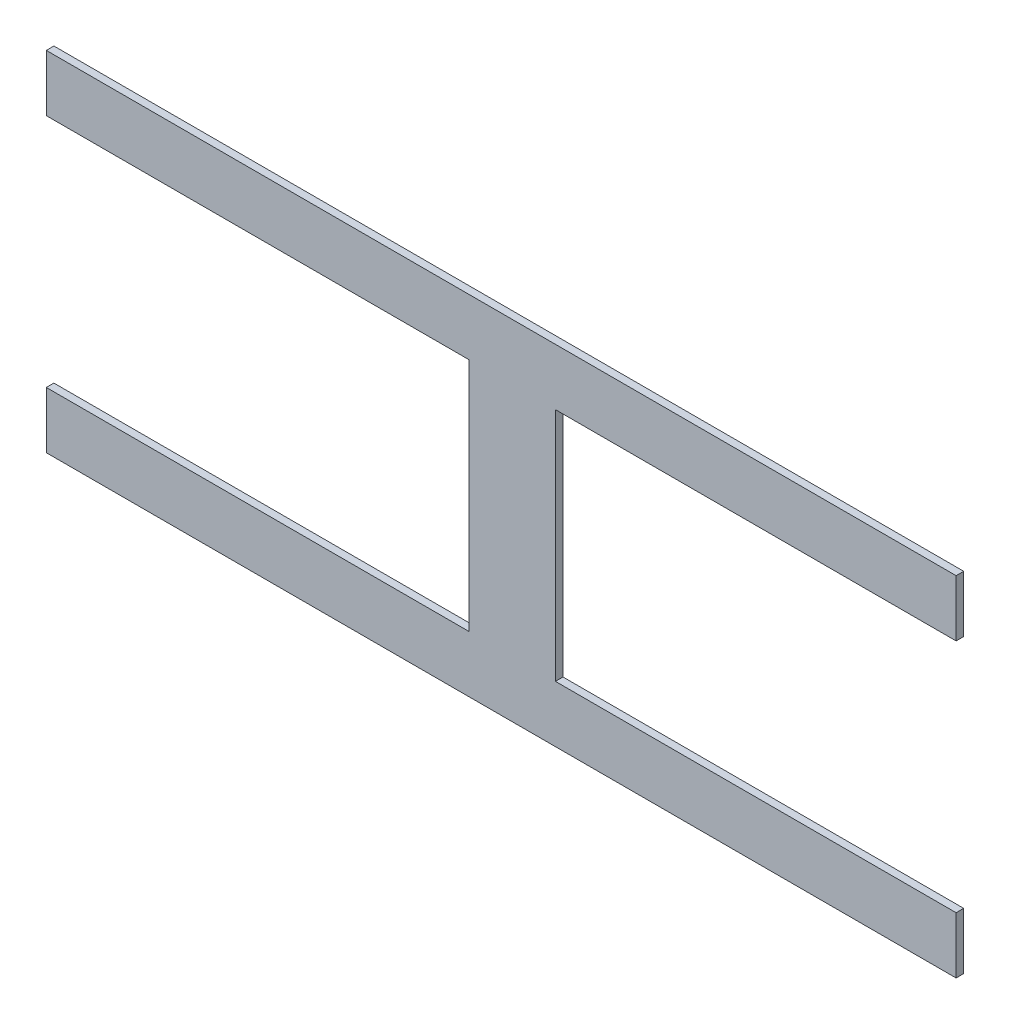
ISO-10303-21;
HEADER;
FILE_DESCRIPTION(('STEP AP214'),'2;1');
FILE_NAME('part.step','',(''),(''),'','','');
FILE_SCHEMA(('AUTOMOTIVE_DESIGN { 1 0 10303 214 1 1 1 1 }'));
ENDSEC;
DATA;
#1=APPLICATION_CONTEXT('core data for automotive mechanical design processes');
#2=APPLICATION_PROTOCOL_DEFINITION('international standard','automotive_design',2000,#1);
#3=PRODUCT_CONTEXT('',#1,'mechanical');
#4=PRODUCT('Part','Part','',(#3));
#5=PRODUCT_RELATED_PRODUCT_CATEGORY('part','',(#4));
#6=PRODUCT_DEFINITION_FORMATION('','',#4);
#7=PRODUCT_DEFINITION_CONTEXT('part definition',#1,'design');
#8=PRODUCT_DEFINITION('design','',#6,#7);
#9=PRODUCT_DEFINITION_SHAPE('','',#8);
#10=(LENGTH_UNIT() NAMED_UNIT(*) SI_UNIT(.MILLI.,.METRE.));
#11=(NAMED_UNIT(*) PLANE_ANGLE_UNIT() SI_UNIT($,.RADIAN.));
#12=(NAMED_UNIT(*) SI_UNIT($,.STERADIAN.) SOLID_ANGLE_UNIT());
#13=UNCERTAINTY_MEASURE_WITH_UNIT(LENGTH_MEASURE(1.E-05),#10,'distance_accuracy_value','');
#14=(GEOMETRIC_REPRESENTATION_CONTEXT(3) GLOBAL_UNCERTAINTY_ASSIGNED_CONTEXT((#13)) GLOBAL_UNIT_ASSIGNED_CONTEXT((#10,
#11,#12)) REPRESENTATION_CONTEXT('',''));
#15=CARTESIAN_POINT('',(0.,0.,0.));
#16=DIRECTION('',(0.,0.,1.));
#17=DIRECTION('',(1.,0.,0.));
#18=AXIS2_PLACEMENT_3D('',#15,#16,#17);
#19=CARTESIAN_POINT('',(186.200114357348,103.662507702251,5.95));
#20=DIRECTION('',(0.,0.,1.));
#21=DIRECTION('',(1.,0.,0.));
#22=AXIS2_PLACEMENT_3D('',#19,#20,#21);
#23=PLANE('',#22);
#24=DIRECTION('',(1.,0.,0.));
#25=VECTOR('',#24,1.);
#26=CARTESIAN_POINT('',(186.200114357348,104.035397736619,5.95));
#27=LINE('',#26,#25);
#28=CARTESIAN_POINT('',(198.200000000001,104.035397736619,5.95));
#29=VERTEX_POINT('',#28);
#30=CARTESIAN_POINT('',(186.200114357348,104.035397736619,5.95));
#31=VERTEX_POINT('',#30);
#32=EDGE_CURVE('E175',#29,#31,#27,.F.);
#33=ORIENTED_EDGE('',*,*,#32,.F.);
#34=DIRECTION('',(0.,1.,0.));
#35=VECTOR('',#34,1.);
#36=CARTESIAN_POINT('',(198.200000000001,104.035397736619,5.95));
#37=LINE('',#36,#35);
#38=CARTESIAN_POINT('',(198.200000000001,103.289617667884,5.95));
#39=VERTEX_POINT('',#38);
#40=EDGE_CURVE('E170',#39,#29,#37,.T.);
#41=ORIENTED_EDGE('',*,*,#40,.F.);
#42=DIRECTION('',(1.,0.,0.));
#43=VECTOR('',#42,1.);
#44=CARTESIAN_POINT('',(198.200000000001,103.289617667884,5.95));
#45=LINE('',#44,#43);
#46=CARTESIAN_POINT('',(192.914714211389,103.289617667884,5.95));
#47=VERTEX_POINT('',#46);
#48=EDGE_CURVE('E164',#47,#39,#45,.T.);
#49=ORIENTED_EDGE('',*,*,#48,.F.);
#50=DIRECTION('',(0.,1.,0.));
#51=VECTOR('',#50,1.);
#52=CARTESIAN_POINT('',(192.914714211389,103.289617667884,5.95));
#53=LINE('',#52,#51);
#54=CARTESIAN_POINT('',(192.914714211389,100.185329464155,5.95));
#55=VERTEX_POINT('',#54);
#56=EDGE_CURVE('E158',#55,#47,#53,.T.);
#57=ORIENTED_EDGE('',*,*,#56,.F.);
#58=DIRECTION('',(1.,0.,0.));
#59=VECTOR('',#58,1.);
#60=CARTESIAN_POINT('',(192.914714211389,100.185329464155,5.95));
#61=LINE('',#60,#59);
#62=CARTESIAN_POINT('',(198.200000000001,100.185329464155,5.95));
#63=VERTEX_POINT('',#62);
#64=EDGE_CURVE('E152',#63,#55,#61,.F.);
#65=ORIENTED_EDGE('',*,*,#64,.F.);
#66=DIRECTION('',(0.,1.,0.));
#67=VECTOR('',#66,1.);
#68=CARTESIAN_POINT('',(198.200000000001,100.185329464155,5.95));
#69=LINE('',#68,#67);
#70=CARTESIAN_POINT('',(198.200000000001,99.4395493954192,5.95));
#71=VERTEX_POINT('',#70);
#72=EDGE_CURVE('E146',#71,#63,#69,.T.);
#73=ORIENTED_EDGE('',*,*,#72,.F.);
#74=DIRECTION('',(1.,0.,0.));
#75=VECTOR('',#74,1.);
#76=CARTESIAN_POINT('',(198.200000000001,99.4395493954192,5.95));
#77=LINE('',#76,#75);
#78=CARTESIAN_POINT('',(186.200114357348,99.4395493954192,5.95));
#79=VERTEX_POINT('',#78);
#80=EDGE_CURVE('E140',#79,#71,#77,.T.);
#81=ORIENTED_EDGE('',*,*,#80,.F.);
#82=DIRECTION('',(0.,1.,0.));
#83=VECTOR('',#82,1.);
#84=CARTESIAN_POINT('',(186.200114357348,99.4395493954192,5.95));
#85=LINE('',#84,#83);
#86=CARTESIAN_POINT('',(186.200114357348,100.185329464155,5.95));
#87=VERTEX_POINT('',#86);
#88=EDGE_CURVE('E134',#87,#79,#85,.F.);
#89=ORIENTED_EDGE('',*,*,#88,.F.);
#90=DIRECTION('',(1.,0.,0.));
#91=VECTOR('',#90,1.);
#92=CARTESIAN_POINT('',(186.200114357348,100.185329464155,5.95));
#93=LINE('',#92,#91);
#94=CARTESIAN_POINT('',(191.774439212524,100.185329464155,5.95));
#95=VERTEX_POINT('',#94);
#96=EDGE_CURVE('E128',#95,#87,#93,.F.);
#97=ORIENTED_EDGE('',*,*,#96,.F.);
#98=DIRECTION('',(0.,1.,0.));
#99=VECTOR('',#98,1.);
#100=CARTESIAN_POINT('',(191.774439212524,100.185329464155,5.95));
#101=LINE('',#100,#99);
#102=CARTESIAN_POINT('',(191.774439212524,103.289617667884,5.95));
#103=VERTEX_POINT('',#102);
#104=EDGE_CURVE('E104',#103,#95,#101,.F.);
#105=ORIENTED_EDGE('',*,*,#104,.F.);
#106=DIRECTION('',(1.,0.,0.));
#107=VECTOR('',#106,1.);
#108=CARTESIAN_POINT('',(191.774439212524,103.289617667884,5.95));
#109=LINE('',#108,#107);
#110=CARTESIAN_POINT('',(186.200114357348,103.289617667884,5.95));
#111=VERTEX_POINT('',#110);
#112=EDGE_CURVE('E106',#111,#103,#109,.T.);
#113=ORIENTED_EDGE('',*,*,#112,.F.);
#114=DIRECTION('',(0.,1.,0.));
#115=VECTOR('',#114,1.);
#116=CARTESIAN_POINT('',(186.200114357348,103.289617667884,5.95));
#117=LINE('',#116,#115);
#118=EDGE_CURVE('E20',#31,#111,#117,.F.);
#119=ORIENTED_EDGE('',*,*,#118,.F.);
#120=EDGE_LOOP('',(#33,#41,#49,#57,#65,#73,#81,#89,#97,#105,#113,#119));
#121=FACE_BOUND('',#120,.T.);
#122=ADVANCED_FACE('F17',(#121),#23,.F.);
#123=CARTESIAN_POINT('',(186.200114357348,103.289617667884,6.05));
#124=DIRECTION('',(-1.,0.,0.));
#125=DIRECTION('',(0.,0.,1.));
#126=AXIS2_PLACEMENT_3D('',#123,#124,#125);
#127=PLANE('',#126);
#128=DIRECTION('',(0.,1.,0.));
#129=VECTOR('',#128,1.);
#130=CARTESIAN_POINT('',(186.200114357348,103.662507702251,6.05));
#131=LINE('',#130,#129);
#132=CARTESIAN_POINT('',(186.200114357348,104.035397736619,6.05));
#133=VERTEX_POINT('',#132);
#134=CARTESIAN_POINT('',(186.200114357348,103.289617667884,6.05));
#135=VERTEX_POINT('',#134);
#136=EDGE_CURVE('E179',#133,#135,#131,.F.);
#137=ORIENTED_EDGE('',*,*,#136,.F.);
#138=DIRECTION('',(0.,0.,1.));
#139=VECTOR('',#138,1.);
#140=CARTESIAN_POINT('',(186.200114357348,104.035397736619,6.05));
#141=LINE('',#140,#139);
#142=EDGE_CURVE('E117',#31,#133,#141,.T.);
#143=ORIENTED_EDGE('',*,*,#142,.F.);
#144=ORIENTED_EDGE('',*,*,#118,.T.);
#145=DIRECTION('',(0.,0.,-1.));
#146=VECTOR('',#145,1.);
#147=CARTESIAN_POINT('',(186.200114357348,103.289617667884,6.05));
#148=LINE('',#147,#146);
#149=EDGE_CURVE('E112',#135,#111,#148,.T.);
#150=ORIENTED_EDGE('',*,*,#149,.F.);
#151=EDGE_LOOP('',(#137,#143,#144,#150));
#152=FACE_BOUND('',#151,.T.);
#153=ADVANCED_FACE('F114',(#152),#127,.T.);
#154=CARTESIAN_POINT('',(191.774439212524,103.289617667884,6.05));
#155=DIRECTION('',(0.,-1.,0.));
#156=DIRECTION('',(0.,0.,-1.));
#157=AXIS2_PLACEMENT_3D('',#154,#155,#156);
#158=PLANE('',#157);
#159=DIRECTION('',(1.,0.,0.));
#160=VECTOR('',#159,1.);
#161=CARTESIAN_POINT('',(186.200114357348,103.289617667884,6.05));
#162=LINE('',#161,#160);
#163=CARTESIAN_POINT('',(191.774439212524,103.289617667884,6.05));
#164=VERTEX_POINT('',#163);
#165=EDGE_CURVE('E121',#135,#164,#162,.T.);
#166=ORIENTED_EDGE('',*,*,#165,.F.);
#167=ORIENTED_EDGE('',*,*,#149,.T.);
#168=ORIENTED_EDGE('',*,*,#112,.T.);
#169=DIRECTION('',(0.,0.,1.));
#170=VECTOR('',#169,1.);
#171=CARTESIAN_POINT('',(191.774439212524,103.289617667884,6.05));
#172=LINE('',#171,#170);
#173=EDGE_CURVE('E124',#164,#103,#172,.F.);
#174=ORIENTED_EDGE('',*,*,#173,.F.);
#175=EDGE_LOOP('',(#166,#167,#168,#174));
#176=FACE_BOUND('',#175,.T.);
#177=ADVANCED_FACE('F119',(#176),#158,.T.);
#178=CARTESIAN_POINT('',(191.774439212524,100.185329464155,6.05));
#179=DIRECTION('',(-1.,0.,0.));
#180=DIRECTION('',(0.,0.,1.));
#181=AXIS2_PLACEMENT_3D('',#178,#179,#180);
#182=PLANE('',#181);
#183=DIRECTION('',(0.,1.,0.));
#184=VECTOR('',#183,1.);
#185=CARTESIAN_POINT('',(191.774439212524,103.662507702251,6.05));
#186=LINE('',#185,#184);
#187=CARTESIAN_POINT('',(191.774439212524,100.185329464155,6.05));
#188=VERTEX_POINT('',#187);
#189=EDGE_CURVE('E182',#164,#188,#186,.F.);
#190=ORIENTED_EDGE('',*,*,#189,.F.);
#191=ORIENTED_EDGE('',*,*,#173,.T.);
#192=ORIENTED_EDGE('',*,*,#104,.T.);
#193=DIRECTION('',(0.,0.,1.));
#194=VECTOR('',#193,1.);
#195=CARTESIAN_POINT('',(191.774439212524,100.185329464155,6.05));
#196=LINE('',#195,#194);
#197=EDGE_CURVE('E131',#188,#95,#196,.F.);
#198=ORIENTED_EDGE('',*,*,#197,.F.);
#199=EDGE_LOOP('',(#190,#191,#192,#198));
#200=FACE_BOUND('',#199,.T.);
#201=ADVANCED_FACE('F233',(#200),#182,.T.);
#202=CARTESIAN_POINT('',(186.200114357348,100.185329464155,6.05));
#203=DIRECTION('',(0.,1.,0.));
#204=DIRECTION('',(0.,0.,1.));
#205=AXIS2_PLACEMENT_3D('',#202,#203,#204);
#206=PLANE('',#205);
#207=DIRECTION('',(1.,0.,0.));
#208=VECTOR('',#207,1.);
#209=CARTESIAN_POINT('',(186.200114357348,100.185329464155,6.05));
#210=LINE('',#209,#208);
#211=CARTESIAN_POINT('',(186.200114357348,100.185329464155,6.05));
#212=VERTEX_POINT('',#211);
#213=EDGE_CURVE('E185',#188,#212,#210,.F.);
#214=ORIENTED_EDGE('',*,*,#213,.F.);
#215=ORIENTED_EDGE('',*,*,#197,.T.);
#216=ORIENTED_EDGE('',*,*,#96,.T.);
#217=DIRECTION('',(0.,0.,1.));
#218=VECTOR('',#217,1.);
#219=CARTESIAN_POINT('',(186.200114357348,100.185329464155,6.05));
#220=LINE('',#219,#218);
#221=EDGE_CURVE('E137',#212,#87,#220,.F.);
#222=ORIENTED_EDGE('',*,*,#221,.F.);
#223=EDGE_LOOP('',(#214,#215,#216,#222));
#224=FACE_BOUND('',#223,.T.);
#225=ADVANCED_FACE('F230',(#224),#206,.T.);
#226=CARTESIAN_POINT('',(186.200114357348,99.4395493954192,6.05));
#227=DIRECTION('',(-1.,0.,0.));
#228=DIRECTION('',(0.,0.,1.));
#229=AXIS2_PLACEMENT_3D('',#226,#227,#228);
#230=PLANE('',#229);
#231=DIRECTION('',(0.,1.,0.));
#232=VECTOR('',#231,1.);
#233=CARTESIAN_POINT('',(186.200114357348,103.662507702251,6.05));
#234=LINE('',#233,#232);
#235=CARTESIAN_POINT('',(186.200114357348,99.4395493954192,6.05));
#236=VERTEX_POINT('',#235);
#237=EDGE_CURVE('E188',#212,#236,#234,.F.);
#238=ORIENTED_EDGE('',*,*,#237,.F.);
#239=ORIENTED_EDGE('',*,*,#221,.T.);
#240=ORIENTED_EDGE('',*,*,#88,.T.);
#241=DIRECTION('',(0.,0.,-1.));
#242=VECTOR('',#241,1.);
#243=CARTESIAN_POINT('',(186.200114357348,99.4395493954192,6.05));
#244=LINE('',#243,#242);
#245=EDGE_CURVE('E143',#236,#79,#244,.T.);
#246=ORIENTED_EDGE('',*,*,#245,.F.);
#247=EDGE_LOOP('',(#238,#239,#240,#246));
#248=FACE_BOUND('',#247,.T.);
#249=ADVANCED_FACE('F227',(#248),#230,.T.);
#250=CARTESIAN_POINT('',(198.200000000001,99.4395493954192,6.05));
#251=DIRECTION('',(0.,-1.,0.));
#252=DIRECTION('',(0.,0.,-1.));
#253=AXIS2_PLACEMENT_3D('',#250,#251,#252);
#254=PLANE('',#253);
#255=DIRECTION('',(1.,0.,0.));
#256=VECTOR('',#255,1.);
#257=CARTESIAN_POINT('',(186.200114357348,99.4395493954192,6.05));
#258=LINE('',#257,#256);
#259=CARTESIAN_POINT('',(198.200000000001,99.4395493954192,6.05));
#260=VERTEX_POINT('',#259);
#261=EDGE_CURVE('E191',#236,#260,#258,.T.);
#262=ORIENTED_EDGE('',*,*,#261,.F.);
#263=ORIENTED_EDGE('',*,*,#245,.T.);
#264=ORIENTED_EDGE('',*,*,#80,.T.);
#265=DIRECTION('',(0.,0.,-1.));
#266=VECTOR('',#265,1.);
#267=CARTESIAN_POINT('',(198.200000000001,99.4395493954192,6.05));
#268=LINE('',#267,#266);
#269=EDGE_CURVE('E149',#260,#71,#268,.T.);
#270=ORIENTED_EDGE('',*,*,#269,.F.);
#271=EDGE_LOOP('',(#262,#263,#264,#270));
#272=FACE_BOUND('',#271,.T.);
#273=ADVANCED_FACE('F224',(#272),#254,.T.);
#274=CARTESIAN_POINT('',(198.200000000001,100.185329464155,6.05));
#275=DIRECTION('',(1.,0.,0.));
#276=DIRECTION('',(0.,0.,-1.));
#277=AXIS2_PLACEMENT_3D('',#274,#275,#276);
#278=PLANE('',#277);
#279=DIRECTION('',(0.,1.,0.));
#280=VECTOR('',#279,1.);
#281=CARTESIAN_POINT('',(198.200000000001,103.662507702251,6.05));
#282=LINE('',#281,#280);
#283=CARTESIAN_POINT('',(198.200000000001,100.185329464155,6.05));
#284=VERTEX_POINT('',#283);
#285=EDGE_CURVE('E194',#260,#284,#282,.T.);
#286=ORIENTED_EDGE('',*,*,#285,.F.);
#287=ORIENTED_EDGE('',*,*,#269,.T.);
#288=ORIENTED_EDGE('',*,*,#72,.T.);
#289=DIRECTION('',(0.,0.,1.));
#290=VECTOR('',#289,1.);
#291=CARTESIAN_POINT('',(198.200000000001,100.185329464155,6.05));
#292=LINE('',#291,#290);
#293=EDGE_CURVE('E155',#284,#63,#292,.F.);
#294=ORIENTED_EDGE('',*,*,#293,.F.);
#295=EDGE_LOOP('',(#286,#287,#288,#294));
#296=FACE_BOUND('',#295,.T.);
#297=ADVANCED_FACE('F221',(#296),#278,.T.);
#298=CARTESIAN_POINT('',(192.914714211389,100.185329464155,6.05));
#299=DIRECTION('',(0.,1.,0.));
#300=DIRECTION('',(0.,0.,1.));
#301=AXIS2_PLACEMENT_3D('',#298,#299,#300);
#302=PLANE('',#301);
#303=DIRECTION('',(1.,0.,0.));
#304=VECTOR('',#303,1.);
#305=CARTESIAN_POINT('',(186.200114357348,100.185329464155,6.05));
#306=LINE('',#305,#304);
#307=CARTESIAN_POINT('',(192.914714211389,100.185329464155,6.05));
#308=VERTEX_POINT('',#307);
#309=EDGE_CURVE('E197',#284,#308,#306,.F.);
#310=ORIENTED_EDGE('',*,*,#309,.F.);
#311=ORIENTED_EDGE('',*,*,#293,.T.);
#312=ORIENTED_EDGE('',*,*,#64,.T.);
#313=DIRECTION('',(0.,0.,-1.));
#314=VECTOR('',#313,1.);
#315=CARTESIAN_POINT('',(192.914714211389,100.185329464155,6.05));
#316=LINE('',#315,#314);
#317=EDGE_CURVE('E161',#308,#55,#316,.T.);
#318=ORIENTED_EDGE('',*,*,#317,.F.);
#319=EDGE_LOOP('',(#310,#311,#312,#318));
#320=FACE_BOUND('',#319,.T.);
#321=ADVANCED_FACE('F218',(#320),#302,.T.);
#322=CARTESIAN_POINT('',(192.914714211389,103.289617667884,6.05));
#323=DIRECTION('',(1.,0.,0.));
#324=DIRECTION('',(0.,0.,-1.));
#325=AXIS2_PLACEMENT_3D('',#322,#323,#324);
#326=PLANE('',#325);
#327=DIRECTION('',(0.,1.,0.));
#328=VECTOR('',#327,1.);
#329=CARTESIAN_POINT('',(192.914714211389,103.662507702251,6.05));
#330=LINE('',#329,#328);
#331=CARTESIAN_POINT('',(192.914714211389,103.289617667884,6.05));
#332=VERTEX_POINT('',#331);
#333=EDGE_CURVE('E200',#308,#332,#330,.T.);
#334=ORIENTED_EDGE('',*,*,#333,.F.);
#335=ORIENTED_EDGE('',*,*,#317,.T.);
#336=ORIENTED_EDGE('',*,*,#56,.T.);
#337=DIRECTION('',(0.,0.,-1.));
#338=VECTOR('',#337,1.);
#339=CARTESIAN_POINT('',(192.914714211389,103.289617667884,6.05));
#340=LINE('',#339,#338);
#341=EDGE_CURVE('E167',#332,#47,#340,.T.);
#342=ORIENTED_EDGE('',*,*,#341,.F.);
#343=EDGE_LOOP('',(#334,#335,#336,#342));
#344=FACE_BOUND('',#343,.T.);
#345=ADVANCED_FACE('F215',(#344),#326,.T.);
#346=CARTESIAN_POINT('',(198.200000000001,103.289617667884,6.05));
#347=DIRECTION('',(0.,-1.,0.));
#348=DIRECTION('',(0.,0.,-1.));
#349=AXIS2_PLACEMENT_3D('',#346,#347,#348);
#350=PLANE('',#349);
#351=DIRECTION('',(1.,0.,0.));
#352=VECTOR('',#351,1.);
#353=CARTESIAN_POINT('',(186.200114357348,103.289617667884,6.05));
#354=LINE('',#353,#352);
#355=CARTESIAN_POINT('',(198.200000000001,103.289617667884,6.05));
#356=VERTEX_POINT('',#355);
#357=EDGE_CURVE('E203',#332,#356,#354,.T.);
#358=ORIENTED_EDGE('',*,*,#357,.F.);
#359=ORIENTED_EDGE('',*,*,#341,.T.);
#360=ORIENTED_EDGE('',*,*,#48,.T.);
#361=DIRECTION('',(0.,0.,-1.));
#362=VECTOR('',#361,1.);
#363=CARTESIAN_POINT('',(198.200000000001,103.289617667884,6.05));
#364=LINE('',#363,#362);
#365=EDGE_CURVE('E172',#356,#39,#364,.T.);
#366=ORIENTED_EDGE('',*,*,#365,.F.);
#367=EDGE_LOOP('',(#358,#359,#360,#366));
#368=FACE_BOUND('',#367,.T.);
#369=ADVANCED_FACE('F212',(#368),#350,.T.);
#370=CARTESIAN_POINT('',(198.200000000001,104.035397736619,6.05));
#371=DIRECTION('',(1.,0.,0.));
#372=DIRECTION('',(0.,0.,-1.));
#373=AXIS2_PLACEMENT_3D('',#370,#371,#372);
#374=PLANE('',#373);
#375=DIRECTION('',(0.,1.,0.));
#376=VECTOR('',#375,1.);
#377=CARTESIAN_POINT('',(198.200000000001,103.662507702251,6.05));
#378=LINE('',#377,#376);
#379=CARTESIAN_POINT('',(198.200000000001,104.035397736619,6.05));
#380=VERTEX_POINT('',#379);
#381=EDGE_CURVE('E26',#356,#380,#378,.T.);
#382=ORIENTED_EDGE('',*,*,#381,.F.);
#383=ORIENTED_EDGE('',*,*,#365,.T.);
#384=ORIENTED_EDGE('',*,*,#40,.T.);
#385=DIRECTION('',(0.,0.,1.));
#386=VECTOR('',#385,1.);
#387=CARTESIAN_POINT('',(198.200000000001,104.035397736619,6.05));
#388=LINE('',#387,#386);
#389=EDGE_CURVE('E35',#380,#29,#388,.F.);
#390=ORIENTED_EDGE('',*,*,#389,.F.);
#391=EDGE_LOOP('',(#382,#383,#384,#390));
#392=FACE_BOUND('',#391,.T.);
#393=ADVANCED_FACE('F210',(#392),#374,.T.);
#394=CARTESIAN_POINT('',(186.200114357348,104.035397736619,6.05));
#395=DIRECTION('',(0.,1.,0.));
#396=DIRECTION('',(0.,0.,1.));
#397=AXIS2_PLACEMENT_3D('',#394,#395,#396);
#398=PLANE('',#397);
#399=DIRECTION('',(1.,0.,0.));
#400=VECTOR('',#399,1.);
#401=CARTESIAN_POINT('',(186.200114357348,104.035397736619,6.05));
#402=LINE('',#401,#400);
#403=EDGE_CURVE('E11',#380,#133,#402,.F.);
#404=ORIENTED_EDGE('',*,*,#403,.F.);
#405=ORIENTED_EDGE('',*,*,#389,.T.);
#406=ORIENTED_EDGE('',*,*,#32,.T.);
#407=ORIENTED_EDGE('',*,*,#142,.T.);
#408=EDGE_LOOP('',(#404,#405,#406,#407));
#409=FACE_BOUND('',#408,.T.);
#410=ADVANCED_FACE('F235',(#409),#398,.T.);
#411=CARTESIAN_POINT('',(186.200114357348,103.662507702251,6.05));
#412=DIRECTION('',(0.,0.,1.));
#413=DIRECTION('',(1.,0.,0.));
#414=AXIS2_PLACEMENT_3D('',#411,#412,#413);
#415=PLANE('',#414);
#416=ORIENTED_EDGE('',*,*,#381,.T.);
#417=ORIENTED_EDGE('',*,*,#403,.T.);
#418=ORIENTED_EDGE('',*,*,#136,.T.);
#419=ORIENTED_EDGE('',*,*,#165,.T.);
#420=ORIENTED_EDGE('',*,*,#189,.T.);
#421=ORIENTED_EDGE('',*,*,#213,.T.);
#422=ORIENTED_EDGE('',*,*,#237,.T.);
#423=ORIENTED_EDGE('',*,*,#261,.T.);
#424=ORIENTED_EDGE('',*,*,#285,.T.);
#425=ORIENTED_EDGE('',*,*,#309,.T.);
#426=ORIENTED_EDGE('',*,*,#333,.T.);
#427=ORIENTED_EDGE('',*,*,#357,.T.);
#428=EDGE_LOOP('',(#416,#417,#418,#419,#420,#421,#422,#423,#424,#425,#426,#427));
#429=FACE_BOUND('',#428,.T.);
#430=ADVANCED_FACE('F208',(#429),#415,.T.);
#431=CLOSED_SHELL('',(#122,#153,#177,#201,#225,#249,#273,#297,#321,#345,#369,#393,#410,#430));
#432=MANIFOLD_SOLID_BREP('B1',#431);
#433=ADVANCED_BREP_SHAPE_REPRESENTATION('',(#18,#432),#14);
#434=SHAPE_DEFINITION_REPRESENTATION(#9,#433);
ENDSEC;
END-ISO-10303-21;
